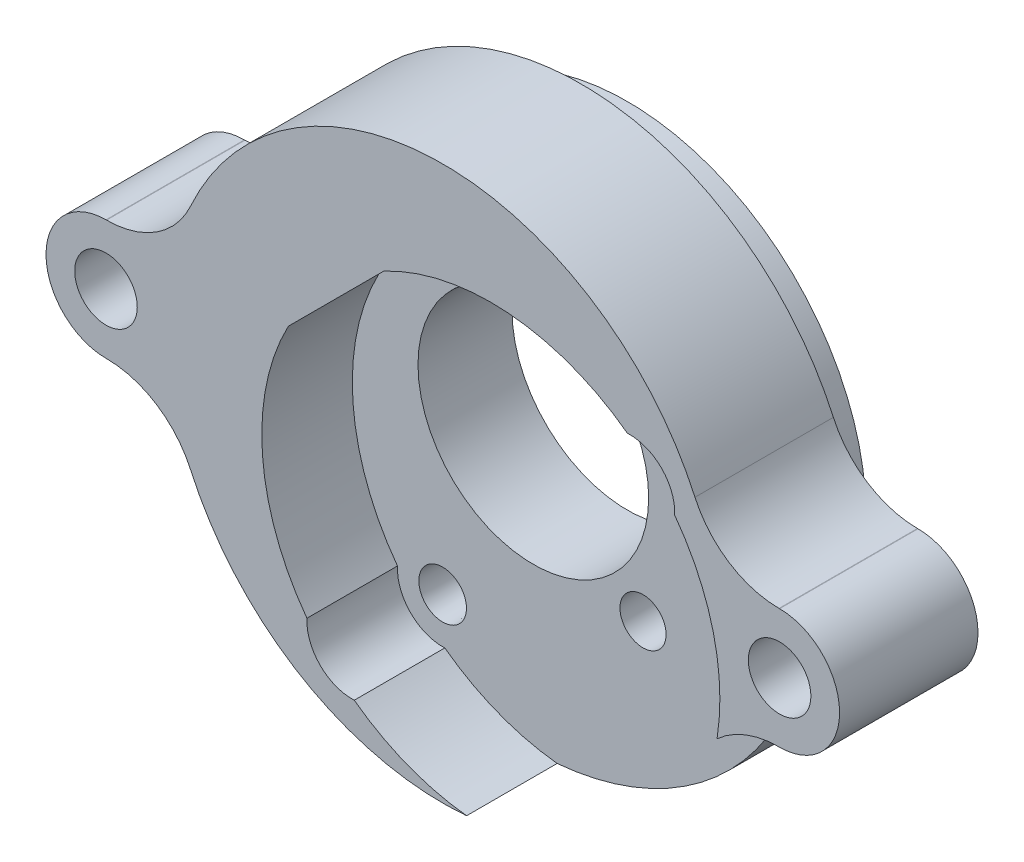
ISO-10303-21;
HEADER;
FILE_DESCRIPTION(('STEP AP214'),'2;1');
FILE_NAME('part.step','',(''),(''),'','','');
FILE_SCHEMA(('AUTOMOTIVE_DESIGN { 1 0 10303 214 1 1 1 1 }'));
ENDSEC;
DATA;
#1=APPLICATION_CONTEXT('core data for automotive mechanical design processes');
#2=APPLICATION_PROTOCOL_DEFINITION('international standard','automotive_design',2000,#1);
#3=PRODUCT_CONTEXT('',#1,'mechanical');
#4=PRODUCT('Part','Part','',(#3));
#5=PRODUCT_RELATED_PRODUCT_CATEGORY('part','',(#4));
#6=PRODUCT_DEFINITION_FORMATION('','',#4);
#7=PRODUCT_DEFINITION_CONTEXT('part definition',#1,'design');
#8=PRODUCT_DEFINITION('design','',#6,#7);
#9=PRODUCT_DEFINITION_SHAPE('','',#8);
#10=(LENGTH_UNIT() NAMED_UNIT(*) SI_UNIT(.MILLI.,.METRE.));
#11=(NAMED_UNIT(*) PLANE_ANGLE_UNIT() SI_UNIT($,.RADIAN.));
#12=(NAMED_UNIT(*) SI_UNIT($,.STERADIAN.) SOLID_ANGLE_UNIT());
#13=UNCERTAINTY_MEASURE_WITH_UNIT(LENGTH_MEASURE(1.E-05),#10,'distance_accuracy_value','');
#14=(GEOMETRIC_REPRESENTATION_CONTEXT(3) GLOBAL_UNCERTAINTY_ASSIGNED_CONTEXT((#13)) GLOBAL_UNIT_ASSIGNED_CONTEXT((#10,
#11,#12)) REPRESENTATION_CONTEXT('',''));
#15=CARTESIAN_POINT('',(0.,0.,0.));
#16=DIRECTION('',(0.,0.,1.));
#17=DIRECTION('',(1.,0.,0.));
#18=AXIS2_PLACEMENT_3D('',#15,#16,#17);
#19=CARTESIAN_POINT('',(3.30562119926443,-3.30562119926438,6.47000000000001));
#20=DIRECTION('',(0.,0.,-1.));
#21=DIRECTION('',(0.707106781186554,-0.707106781186541,0.));
#22=AXIS2_PLACEMENT_3D('',#19,#20,#21);
#23=PLANE('',#22);
#24=CARTESIAN_POINT('',(-6.24032034675388,-12.8515627452829,6.47000000000001));
#25=DIRECTION('',(0.,0.,1.));
#26=DIRECTION('',(1.,0.,0.));
#27=AXIS2_PLACEMENT_3D('',#24,#25,#26);
#28=CIRCLE('',#27,1.63830000000001);
#29=CARTESIAN_POINT('',(-4.60202034675387,-12.8515627452829,6.47000000000001));
#30=VERTEX_POINT('',#29);
#31=EDGE_CURVE('E504',#30,#30,#28,.T.);
#32=ORIENTED_EDGE('',*,*,#31,.F.);
#33=EDGE_LOOP('',(#32));
#34=FACE_BOUND('',#33,.T.);
#35=CARTESIAN_POINT('',(7.54826188638375,-7.54826188638363,6.47000000000001));
#36=DIRECTION('',(0.,0.,-1.));
#37=DIRECTION('',(-1.,0.,0.));
#38=AXIS2_PLACEMENT_3D('',#35,#36,#37);
#39=CIRCLE('',#38,1.5875);
#40=CARTESIAN_POINT('',(5.96076188638375,-7.54826188638363,6.47000000000001));
#41=VERTEX_POINT('',#40);
#42=EDGE_CURVE('E439',#41,#41,#39,.T.);
#43=ORIENTED_EDGE('',*,*,#42,.T.);
#44=EDGE_LOOP('',(#43));
#45=FACE_BOUND('',#44,.T.);
#46=CARTESIAN_POINT('',(0.,0.,6.47000000000001));
#47=DIRECTION('',(0.,0.,-1.));
#48=DIRECTION('',(-1.,0.,0.));
#49=AXIS2_PLACEMENT_3D('',#46,#47,#48);
#50=CIRCLE('',#49,7.9375);
#51=CARTESIAN_POINT('',(-7.9375,0.,6.47000000000001));
#52=VERTEX_POINT('',#51);
#53=EDGE_CURVE('E287',#52,#52,#50,.T.);
#54=ORIENTED_EDGE('',*,*,#53,.T.);
#55=EDGE_LOOP('',(#54));
#56=FACE_BOUND('',#55,.T.);
#57=CARTESIAN_POINT('',(23.1383230539726,-10.4775,6.47000000000001));
#58=DIRECTION('',(0.,0.,-1.));
#59=DIRECTION('',(-1.,0.,0.));
#60=AXIS2_PLACEMENT_3D('',#57,#58,#59);
#61=CIRCLE('',#60,6.35);
#62=CARTESIAN_POINT('',(18.8732975897662,-5.77302789468675,6.47000000000001));
#63=VERTEX_POINT('',#62);
#64=CARTESIAN_POINT('',(17.3537422904795,-7.85812500000001,6.47000000000001));
#65=VERTEX_POINT('',#64);
#66=EDGE_CURVE('E12',#63,#65,#61,.F.);
#67=ORIENTED_EDGE('',*,*,#66,.F.);
#68=CARTESIAN_POINT('',(3.30562119926443,-3.30562119926438,6.47000000000001));
#69=DIRECTION('',(0.,0.,-1.));
#70=DIRECTION('',(-1.,0.,0.));
#71=AXIS2_PLACEMENT_3D('',#68,#69,#70);
#72=CIRCLE('',#71,15.762);
#73=CARTESIAN_POINT('',(15.9600056462192,6.09156977829212,6.47000000000001));
#74=VERTEX_POINT('',#73);
#75=EDGE_CURVE('E67',#63,#74,#72,.F.);
#76=ORIENTED_EDGE('',*,*,#75,.T.);
#77=CARTESIAN_POINT('',(12.8515627452827,6.2403203467541,6.47000000000001));
#78=DIRECTION('',(0.,0.,-1.));
#79=DIRECTION('',(-1.,0.,0.));
#80=AXIS2_PLACEMENT_3D('',#77,#78,#79);
#81=CIRCLE('',#80,3.11200000000001);
#82=CARTESIAN_POINT('',(12.7028121768207,9.34876324769056,6.47000000000001));
#83=VERTEX_POINT('',#82);
#84=EDGE_CURVE('E257',#74,#83,#81,.F.);
#85=ORIENTED_EDGE('',*,*,#84,.T.);
#86=CARTESIAN_POINT('',(3.30562119926443,-3.30562119926438,6.47000000000001));
#87=DIRECTION('',(0.,0.,-1.));
#88=DIRECTION('',(-1.,0.,0.));
#89=AXIS2_PLACEMENT_3D('',#86,#87,#88);
#90=CIRCLE('',#89,15.762);
#91=CARTESIAN_POINT('',(-4.06025115189155,10.6293911260433,6.47000000000001));
#92=VERTEX_POINT('',#91);
#93=EDGE_CURVE('E239',#83,#92,#90,.F.);
#94=ORIENTED_EDGE('',*,*,#93,.T.);
#95=DIRECTION('',(-0.707106781186541,-0.707106781186554,0.));
#96=VECTOR('',#95,1.);
#97=CARTESIAN_POINT('',(-4.06025115189155,10.6293911260433,6.47000000000001));
#98=LINE('',#97,#96);
#99=CARTESIAN_POINT('',(-10.6293911260433,4.06025115189135,6.47000000000001));
#100=VERTEX_POINT('',#99);
#101=EDGE_CURVE('E230',#92,#100,#98,.T.);
#102=ORIENTED_EDGE('',*,*,#101,.T.);
#103=CARTESIAN_POINT('',(3.30562119926443,-3.30562119926438,6.47000000000001));
#104=DIRECTION('',(0.,0.,-1.));
#105=DIRECTION('',(-1.,0.,0.));
#106=AXIS2_PLACEMENT_3D('',#103,#104,#105);
#107=CIRCLE('',#106,15.762);
#108=CARTESIAN_POINT('',(-9.34876324769033,-12.7028121768209,6.47000000000001));
#109=VERTEX_POINT('',#108);
#110=EDGE_CURVE('E216',#100,#109,#107,.F.);
#111=ORIENTED_EDGE('',*,*,#110,.T.);
#112=CARTESIAN_POINT('',(-6.24032034675388,-12.8515627452829,6.47000000000001));
#113=DIRECTION('',(0.,0.,-1.));
#114=DIRECTION('',(-1.,0.,0.));
#115=AXIS2_PLACEMENT_3D('',#112,#113,#114);
#116=CIRCLE('',#115,3.112);
#117=CARTESIAN_POINT('',(-6.09156977829186,-15.9600056462193,6.47000000000001));
#118=VERTEX_POINT('',#117);
#119=EDGE_CURVE('E265',#109,#118,#116,.F.);
#120=ORIENTED_EDGE('',*,*,#119,.T.);
#121=CARTESIAN_POINT('',(1.63951827430508,-18.9793171591662,6.47000000000001));
#122=VERTEX_POINT('',#121);
#123=EDGE_CURVE('E261',#118,#122,#72,.F.);
#124=ORIENTED_EDGE('',*,*,#123,.T.);
#125=CARTESIAN_POINT('',(0.,0.,6.47000000000001));
#126=DIRECTION('',(0.,0.,-1.));
#127=DIRECTION('',(-1.,0.,0.));
#128=AXIS2_PLACEMENT_3D('',#125,#126,#127);
#129=CIRCLE('',#128,19.05);
#130=EDGE_CURVE('E283',#65,#122,#129,.T.);
#131=ORIENTED_EDGE('',*,*,#130,.F.);
#132=EDGE_LOOP('',(#67,#76,#85,#94,#102,#111,#120,#124,#131));
#133=FACE_BOUND('',#132,.T.);
#134=CARTESIAN_POINT('',(12.8515627452827,6.2403203467541,6.47000000000001));
#135=DIRECTION('',(0.,0.,1.));
#136=DIRECTION('',(1.,0.,0.));
#137=AXIS2_PLACEMENT_3D('',#134,#135,#136);
#138=CIRCLE('',#137,1.63830000000001);
#139=CARTESIAN_POINT('',(14.4898627452828,6.2403203467541,6.47000000000001));
#140=VERTEX_POINT('',#139);
#141=EDGE_CURVE('E457',#140,#140,#138,.T.);
#142=ORIENTED_EDGE('',*,*,#141,.F.);
#143=EDGE_LOOP('',(#142));
#144=FACE_BOUND('',#143,.T.);
#145=ADVANCED_FACE('F46',(#34,#45,#56,#133,#144),#23,.F.);
#146=CARTESIAN_POINT('',(23.1775,0.,3.175));
#147=DIRECTION('',(0.,0.,1.));
#148=DIRECTION('',(1.,0.,0.));
#149=AXIS2_PLACEMENT_3D('',#146,#147,#148);
#150=PLANE('',#149);
#151=CARTESIAN_POINT('',(23.1775,0.,3.175));
#152=DIRECTION('',(0.,0.,-1.));
#153=DIRECTION('',(-1.,0.,0.));
#154=AXIS2_PLACEMENT_3D('',#151,#152,#153);
#155=CIRCLE('',#154,2.65430000000001);
#156=CARTESIAN_POINT('',(20.5232,0.,3.175));
#157=VERTEX_POINT('',#156);
#158=EDGE_CURVE('E291',#157,#157,#155,.T.);
#159=ORIENTED_EDGE('',*,*,#158,.F.);
#160=EDGE_LOOP('',(#159));
#161=FACE_BOUND('',#160,.T.);
#162=CARTESIAN_POINT('',(-23.1775,0.,3.175));
#163=DIRECTION('',(0.,0.,-1.));
#164=DIRECTION('',(-1.,0.,0.));
#165=AXIS2_PLACEMENT_3D('',#162,#163,#164);
#166=CIRCLE('',#165,2.65430000000001);
#167=CARTESIAN_POINT('',(-25.8318,0.,3.175));
#168=VERTEX_POINT('',#167);
#169=EDGE_CURVE('E300',#168,#168,#166,.T.);
#170=ORIENTED_EDGE('',*,*,#169,.F.);
#171=EDGE_LOOP('',(#170));
#172=FACE_BOUND('',#171,.T.);
#173=CARTESIAN_POINT('',(0.,0.,3.175));
#174=DIRECTION('',(0.,0.,1.));
#175=DIRECTION('',(1.,0.,0.));
#176=AXIS2_PLACEMENT_3D('',#173,#174,#175);
#177=CIRCLE('',#176,16.4211);
#178=CARTESIAN_POINT('',(16.4211,0.,3.175));
#179=VERTEX_POINT('',#178);
#180=EDGE_CURVE('E428',#179,#179,#177,.T.);
#181=ORIENTED_EDGE('',*,*,#180,.T.);
#182=EDGE_LOOP('',(#181));
#183=FACE_BOUND('',#182,.T.);
#184=CARTESIAN_POINT('',(23.1775,0.,3.175));
#185=DIRECTION('',(0.,0.,1.));
#186=DIRECTION('',(1.,0.,0.));
#187=AXIS2_PLACEMENT_3D('',#184,#185,#186);
#188=CIRCLE('',#187,4.1275);
#189=CARTESIAN_POINT('',(23.1775,-4.1275,3.175));
#190=VERTEX_POINT('',#189);
#191=CARTESIAN_POINT('',(23.1775,4.1275,3.175));
#192=VERTEX_POINT('',#191);
#193=EDGE_CURVE('E314',#190,#192,#188,.T.);
#194=ORIENTED_EDGE('',*,*,#193,.F.);
#195=DIRECTION('',(1.,0.,0.));
#196=VECTOR('',#195,1.);
#197=CARTESIAN_POINT('',(23.1383230539726,-4.1275,3.175));
#198=LINE('',#197,#196);
#199=CARTESIAN_POINT('',(23.1383230539726,-4.1275,3.175));
#200=VERTEX_POINT('',#199);
#201=EDGE_CURVE('E353',#200,#190,#198,.T.);
#202=ORIENTED_EDGE('',*,*,#201,.F.);
#203=CARTESIAN_POINT('',(23.1383230539726,-10.4775,3.175));
#204=DIRECTION('',(0.,0.,-1.));
#205=DIRECTION('',(1.,0.,0.));
#206=AXIS2_PLACEMENT_3D('',#203,#204,#205);
#207=CIRCLE('',#206,6.35);
#208=CARTESIAN_POINT('',(17.3537422904795,-7.85812500000001,3.175));
#209=VERTEX_POINT('',#208);
#210=EDGE_CURVE('E349',#209,#200,#207,.T.);
#211=ORIENTED_EDGE('',*,*,#210,.F.);
#212=CARTESIAN_POINT('',(0.,0.,3.175));
#213=DIRECTION('',(0.,0.,1.));
#214=DIRECTION('',(1.,0.,0.));
#215=AXIS2_PLACEMENT_3D('',#212,#213,#214);
#216=CIRCLE('',#215,19.05);
#217=CARTESIAN_POINT('',(-17.3537422904795,-7.858125,3.175));
#218=VERTEX_POINT('',#217);
#219=EDGE_CURVE('E345',#218,#209,#216,.T.);
#220=ORIENTED_EDGE('',*,*,#219,.F.);
#221=CARTESIAN_POINT('',(-23.1383230539726,-10.4775,3.175));
#222=DIRECTION('',(0.,0.,-1.));
#223=DIRECTION('',(1.,0.,0.));
#224=AXIS2_PLACEMENT_3D('',#221,#222,#223);
#225=CIRCLE('',#224,6.35);
#226=CARTESIAN_POINT('',(-23.1383230539726,-4.1275,3.175));
#227=VERTEX_POINT('',#226);
#228=EDGE_CURVE('E342',#227,#218,#225,.T.);
#229=ORIENTED_EDGE('',*,*,#228,.F.);
#230=DIRECTION('',(1.,0.,0.));
#231=VECTOR('',#230,1.);
#232=CARTESIAN_POINT('',(-23.1775,-4.1275,3.175));
#233=LINE('',#232,#231);
#234=CARTESIAN_POINT('',(-23.1775,-4.1275,3.175));
#235=VERTEX_POINT('',#234);
#236=EDGE_CURVE('E339',#235,#227,#233,.T.);
#237=ORIENTED_EDGE('',*,*,#236,.F.);
#238=CARTESIAN_POINT('',(-23.1775,0.,3.175));
#239=DIRECTION('',(0.,0.,1.));
#240=DIRECTION('',(1.,0.,0.));
#241=AXIS2_PLACEMENT_3D('',#238,#239,#240);
#242=CIRCLE('',#241,4.1275);
#243=CARTESIAN_POINT('',(-23.1775,4.1275,3.175));
#244=VERTEX_POINT('',#243);
#245=EDGE_CURVE('E336',#244,#235,#242,.T.);
#246=ORIENTED_EDGE('',*,*,#245,.F.);
#247=DIRECTION('',(-1.,0.,0.));
#248=VECTOR('',#247,1.);
#249=CARTESIAN_POINT('',(-23.1383230539726,4.1275,3.175));
#250=LINE('',#249,#248);
#251=CARTESIAN_POINT('',(-23.1383230539726,4.1275,3.175));
#252=VERTEX_POINT('',#251);
#253=EDGE_CURVE('E333',#252,#244,#250,.T.);
#254=ORIENTED_EDGE('',*,*,#253,.F.);
#255=CARTESIAN_POINT('',(-23.1383230539726,10.4775,3.175));
#256=DIRECTION('',(0.,0.,-1.));
#257=DIRECTION('',(1.,0.,0.));
#258=AXIS2_PLACEMENT_3D('',#255,#256,#257);
#259=CIRCLE('',#258,6.35);
#260=CARTESIAN_POINT('',(-17.3537422904795,7.858125,3.175));
#261=VERTEX_POINT('',#260);
#262=EDGE_CURVE('E330',#261,#252,#259,.T.);
#263=ORIENTED_EDGE('',*,*,#262,.F.);
#264=CARTESIAN_POINT('',(0.,0.,3.175));
#265=DIRECTION('',(0.,0.,1.));
#266=DIRECTION('',(1.,0.,0.));
#267=AXIS2_PLACEMENT_3D('',#264,#265,#266);
#268=CIRCLE('',#267,19.05);
#269=CARTESIAN_POINT('',(17.3537422904795,7.858125,3.175));
#270=VERTEX_POINT('',#269);
#271=EDGE_CURVE('E326',#270,#261,#268,.T.);
#272=ORIENTED_EDGE('',*,*,#271,.F.);
#273=CARTESIAN_POINT('',(23.1383230539726,10.4775,3.175));
#274=DIRECTION('',(0.,0.,-1.));
#275=DIRECTION('',(1.,0.,0.));
#276=AXIS2_PLACEMENT_3D('',#273,#274,#275);
#277=CIRCLE('',#276,6.35);
#278=CARTESIAN_POINT('',(23.1383230539726,4.1275,3.175));
#279=VERTEX_POINT('',#278);
#280=EDGE_CURVE('E322',#279,#270,#277,.T.);
#281=ORIENTED_EDGE('',*,*,#280,.F.);
#282=DIRECTION('',(-1.,0.,0.));
#283=VECTOR('',#282,1.);
#284=CARTESIAN_POINT('',(23.1775,4.1275,3.175));
#285=LINE('',#284,#283);
#286=EDGE_CURVE('E318',#192,#279,#285,.T.);
#287=ORIENTED_EDGE('',*,*,#286,.F.);
#288=EDGE_LOOP('',(#194,#202,#211,#220,#229,#237,#246,#254,#263,#272,#281,#287));
#289=FACE_BOUND('',#288,.T.);
#290=ADVANCED_FACE('F491',(#161,#172,#183,#289),#150,.F.);
#291=CARTESIAN_POINT('',(0.,0.,6.35));
#292=DIRECTION('',(0.,0.,-1.));
#293=DIRECTION('',(-1.,0.,0.));
#294=AXIS2_PLACEMENT_3D('',#291,#292,#293);
#295=CYLINDRICAL_SURFACE('',#294,16.4211);
#296=CARTESIAN_POINT('',(0.,0.,0.));
#297=DIRECTION('',(0.,0.,1.));
#298=DIRECTION('',(1.,0.,0.));
#299=AXIS2_PLACEMENT_3D('',#296,#297,#298);
#300=CIRCLE('',#299,16.4211);
#301=CARTESIAN_POINT('',(16.4211,0.,0.));
#302=VERTEX_POINT('',#301);
#303=EDGE_CURVE('E424',#302,#302,#300,.T.);
#304=ORIENTED_EDGE('',*,*,#303,.T.);
#305=EDGE_LOOP('',(#304));
#306=FACE_BOUND('',#305,.T.);
#307=ORIENTED_EDGE('',*,*,#180,.F.);
#308=EDGE_LOOP('',(#307));
#309=FACE_BOUND('',#308,.T.);
#310=ADVANCED_FACE('F536',(#306,#309),#295,.T.);
#311=CARTESIAN_POINT('',(0.,0.,6.35));
#312=DIRECTION('',(0.,0.,-1.));
#313=DIRECTION('',(-1.,0.,0.));
#314=AXIS2_PLACEMENT_3D('',#311,#312,#313);
#315=CYLINDRICAL_SURFACE('',#314,7.9375);
#316=ORIENTED_EDGE('',*,*,#53,.F.);
#317=EDGE_LOOP('',(#316));
#318=FACE_BOUND('',#317,.T.);
#319=CARTESIAN_POINT('',(0.,0.,0.));
#320=DIRECTION('',(0.,0.,1.));
#321=DIRECTION('',(1.,0.,0.));
#322=AXIS2_PLACEMENT_3D('',#319,#320,#321);
#323=CIRCLE('',#322,7.9375);
#324=CARTESIAN_POINT('',(7.9375,0.,0.));
#325=VERTEX_POINT('',#324);
#326=EDGE_CURVE('E420',#325,#325,#323,.T.);
#327=ORIENTED_EDGE('',*,*,#326,.F.);
#328=EDGE_LOOP('',(#327));
#329=FACE_BOUND('',#328,.T.);
#330=ADVANCED_FACE('F48',(#318,#329),#315,.F.);
#331=CARTESIAN_POINT('',(0.,0.,0.));
#332=DIRECTION('',(0.,0.,1.));
#333=DIRECTION('',(1.,0.,0.));
#334=AXIS2_PLACEMENT_3D('',#331,#332,#333);
#335=PLANE('',#334);
#336=CARTESIAN_POINT('',(-6.24032034675388,-12.8515627452829,0.));
#337=DIRECTION('',(0.,0.,1.));
#338=DIRECTION('',(1.,0.,0.));
#339=AXIS2_PLACEMENT_3D('',#336,#337,#338);
#340=CIRCLE('',#339,0.927099999999998);
#341=CARTESIAN_POINT('',(-5.31322034675388,-12.8515627452829,0.));
#342=VERTEX_POINT('',#341);
#343=EDGE_CURVE('E520',#342,#342,#340,.T.);
#344=ORIENTED_EDGE('',*,*,#343,.T.);
#345=EDGE_LOOP('',(#344));
#346=FACE_BOUND('',#345,.T.);
#347=CARTESIAN_POINT('',(12.8515627452827,6.2403203467541,0.));
#348=DIRECTION('',(0.,0.,1.));
#349=DIRECTION('',(1.,0.,0.));
#350=AXIS2_PLACEMENT_3D('',#347,#348,#349);
#351=CIRCLE('',#350,0.927099999999998);
#352=CARTESIAN_POINT('',(13.7786627452827,6.2403203467541,0.));
#353=VERTEX_POINT('',#352);
#354=EDGE_CURVE('E505',#353,#353,#351,.T.);
#355=ORIENTED_EDGE('',*,*,#354,.T.);
#356=EDGE_LOOP('',(#355));
#357=FACE_BOUND('',#356,.T.);
#358=CARTESIAN_POINT('',(7.54826188638375,-7.54826188638363,0.));
#359=DIRECTION('',(0.,0.,-1.));
#360=DIRECTION('',(-1.,0.,0.));
#361=AXIS2_PLACEMENT_3D('',#358,#359,#360);
#362=CIRCLE('',#361,1.5875);
#363=CARTESIAN_POINT('',(5.96076188638375,-7.54826188638363,0.));
#364=VERTEX_POINT('',#363);
#365=EDGE_CURVE('E442',#364,#364,#362,.T.);
#366=ORIENTED_EDGE('',*,*,#365,.F.);
#367=EDGE_LOOP('',(#366));
#368=FACE_BOUND('',#367,.T.);
#369=ORIENTED_EDGE('',*,*,#326,.T.);
#370=EDGE_LOOP('',(#369));
#371=FACE_BOUND('',#370,.T.);
#372=ORIENTED_EDGE('',*,*,#303,.F.);
#373=EDGE_LOOP('',(#372));
#374=FACE_BOUND('',#373,.T.);
#375=ADVANCED_FACE('F571',(#346,#357,#368,#371,#374),#335,.F.);
#376=CARTESIAN_POINT('',(23.1775,0.,12.7));
#377=DIRECTION('',(0.,0.,1.));
#378=DIRECTION('',(1.,0.,0.));
#379=AXIS2_PLACEMENT_3D('',#376,#377,#378);
#380=PLANE('',#379);
#381=CARTESIAN_POINT('',(3.30562119926443,-3.30562119926438,12.7));
#382=DIRECTION('',(0.,0.,1.));
#383=DIRECTION('',(1.,0.,0.));
#384=AXIS2_PLACEMENT_3D('',#381,#382,#383);
#385=CIRCLE('',#384,15.762);
#386=CARTESIAN_POINT('',(-6.09156977829186,-15.9600056462193,12.7));
#387=VERTEX_POINT('',#386);
#388=CARTESIAN_POINT('',(1.63951827430508,-18.9793171591662,12.7));
#389=VERTEX_POINT('',#388);
#390=EDGE_CURVE('E247',#387,#389,#385,.T.);
#391=ORIENTED_EDGE('',*,*,#390,.F.);
#392=CARTESIAN_POINT('',(-6.24032034675388,-12.8515627452829,12.7));
#393=DIRECTION('',(0.,0.,1.));
#394=DIRECTION('',(1.,0.,0.));
#395=AXIS2_PLACEMENT_3D('',#392,#393,#394);
#396=CIRCLE('',#395,3.112);
#397=CARTESIAN_POINT('',(-9.34876324769033,-12.7028121768209,12.7));
#398=VERTEX_POINT('',#397);
#399=EDGE_CURVE('E464',#398,#387,#396,.T.);
#400=ORIENTED_EDGE('',*,*,#399,.F.);
#401=CARTESIAN_POINT('',(3.30562119926443,-3.30562119926438,12.7));
#402=DIRECTION('',(0.,0.,1.));
#403=DIRECTION('',(1.,0.,0.));
#404=AXIS2_PLACEMENT_3D('',#401,#402,#403);
#405=CIRCLE('',#404,15.762);
#406=CARTESIAN_POINT('',(-10.6293911260433,4.06025115189135,12.7));
#407=VERTEX_POINT('',#406);
#408=EDGE_CURVE('E468',#407,#398,#405,.T.);
#409=ORIENTED_EDGE('',*,*,#408,.F.);
#410=DIRECTION('',(-0.707106781186541,-0.707106781186554,0.));
#411=VECTOR('',#410,1.);
#412=CARTESIAN_POINT('',(-4.06025115189155,10.6293911260433,12.7));
#413=LINE('',#412,#411);
#414=CARTESIAN_POINT('',(-4.06025115189155,10.6293911260433,12.7));
#415=VERTEX_POINT('',#414);
#416=EDGE_CURVE('E233',#415,#407,#413,.T.);
#417=ORIENTED_EDGE('',*,*,#416,.F.);
#418=CARTESIAN_POINT('',(3.30562119926443,-3.30562119926438,12.7));
#419=DIRECTION('',(0.,0.,1.));
#420=DIRECTION('',(1.,0.,0.));
#421=AXIS2_PLACEMENT_3D('',#418,#419,#420);
#422=CIRCLE('',#421,15.762);
#423=CARTESIAN_POINT('',(12.7028121768207,9.34876324769056,12.7));
#424=VERTEX_POINT('',#423);
#425=EDGE_CURVE('E251',#424,#415,#422,.T.);
#426=ORIENTED_EDGE('',*,*,#425,.F.);
#427=CARTESIAN_POINT('',(12.8515627452827,6.2403203467541,12.7));
#428=DIRECTION('',(0.,0.,1.));
#429=DIRECTION('',(1.,0.,0.));
#430=AXIS2_PLACEMENT_3D('',#427,#428,#429);
#431=CIRCLE('',#430,3.11200000000001);
#432=CARTESIAN_POINT('',(15.9600056462192,6.09156977829212,12.7));
#433=VERTEX_POINT('',#432);
#434=EDGE_CURVE('E242',#433,#424,#431,.T.);
#435=ORIENTED_EDGE('',*,*,#434,.F.);
#436=CARTESIAN_POINT('',(18.8732975897662,-5.77302789468674,12.7));
#437=VERTEX_POINT('',#436);
#438=EDGE_CURVE('E463',#437,#433,#385,.T.);
#439=ORIENTED_EDGE('',*,*,#438,.F.);
#440=CARTESIAN_POINT('',(23.1383230539726,-10.4775,12.7));
#441=DIRECTION('',(0.,0.,-1.));
#442=DIRECTION('',(1.,0.,0.));
#443=AXIS2_PLACEMENT_3D('',#440,#441,#442);
#444=CIRCLE('',#443,6.35);
#445=CARTESIAN_POINT('',(23.1383230539726,-4.1275,12.7));
#446=VERTEX_POINT('',#445);
#447=EDGE_CURVE('E384',#437,#446,#444,.T.);
#448=ORIENTED_EDGE('',*,*,#447,.T.);
#449=DIRECTION('',(1.,0.,0.));
#450=VECTOR('',#449,1.);
#451=CARTESIAN_POINT('',(23.1383230539726,-4.1275,12.7));
#452=LINE('',#451,#450);
#453=CARTESIAN_POINT('',(23.1775,-4.1275,12.7));
#454=VERTEX_POINT('',#453);
#455=EDGE_CURVE('E78',#446,#454,#452,.T.);
#456=ORIENTED_EDGE('',*,*,#455,.T.);
#457=CARTESIAN_POINT('',(23.1775,0.,12.7));
#458=DIRECTION('',(0.,0.,1.));
#459=DIRECTION('',(1.,0.,0.));
#460=AXIS2_PLACEMENT_3D('',#457,#458,#459);
#461=CIRCLE('',#460,4.1275);
#462=CARTESIAN_POINT('',(23.1775,4.1275,12.7));
#463=VERTEX_POINT('',#462);
#464=EDGE_CURVE('E357',#454,#463,#461,.T.);
#465=ORIENTED_EDGE('',*,*,#464,.T.);
#466=DIRECTION('',(-1.,0.,0.));
#467=VECTOR('',#466,1.);
#468=CARTESIAN_POINT('',(23.1775,4.1275,12.7));
#469=LINE('',#468,#467);
#470=CARTESIAN_POINT('',(23.1383230539726,4.1275,12.7));
#471=VERTEX_POINT('',#470);
#472=EDGE_CURVE('E360',#463,#471,#469,.T.);
#473=ORIENTED_EDGE('',*,*,#472,.T.);
#474=CARTESIAN_POINT('',(23.1383230539726,10.4775,12.7));
#475=DIRECTION('',(0.,0.,-1.));
#476=DIRECTION('',(1.,0.,0.));
#477=AXIS2_PLACEMENT_3D('',#474,#475,#476);
#478=CIRCLE('',#477,6.35);
#479=CARTESIAN_POINT('',(17.3537422904795,7.858125,12.7));
#480=VERTEX_POINT('',#479);
#481=EDGE_CURVE('E363',#471,#480,#478,.T.);
#482=ORIENTED_EDGE('',*,*,#481,.T.);
#483=CARTESIAN_POINT('',(0.,0.,12.7));
#484=DIRECTION('',(0.,0.,1.));
#485=DIRECTION('',(1.,0.,0.));
#486=AXIS2_PLACEMENT_3D('',#483,#484,#485);
#487=CIRCLE('',#486,19.05);
#488=CARTESIAN_POINT('',(-17.3537422904795,7.858125,12.7));
#489=VERTEX_POINT('',#488);
#490=EDGE_CURVE('E366',#480,#489,#487,.T.);
#491=ORIENTED_EDGE('',*,*,#490,.T.);
#492=CARTESIAN_POINT('',(-23.1383230539726,10.4775,12.7));
#493=DIRECTION('',(0.,0.,-1.));
#494=DIRECTION('',(1.,0.,0.));
#495=AXIS2_PLACEMENT_3D('',#492,#493,#494);
#496=CIRCLE('',#495,6.35);
#497=CARTESIAN_POINT('',(-23.1383230539726,4.1275,12.7));
#498=VERTEX_POINT('',#497);
#499=EDGE_CURVE('E369',#489,#498,#496,.T.);
#500=ORIENTED_EDGE('',*,*,#499,.T.);
#501=DIRECTION('',(-1.,0.,0.));
#502=VECTOR('',#501,1.);
#503=CARTESIAN_POINT('',(-23.1383230539726,4.1275,12.7));
#504=LINE('',#503,#502);
#505=CARTESIAN_POINT('',(-23.1775,4.1275,12.7));
#506=VERTEX_POINT('',#505);
#507=EDGE_CURVE('E371',#498,#506,#504,.T.);
#508=ORIENTED_EDGE('',*,*,#507,.T.);
#509=CARTESIAN_POINT('',(-23.1775,0.,12.7));
#510=DIRECTION('',(0.,0.,1.));
#511=DIRECTION('',(1.,0.,0.));
#512=AXIS2_PLACEMENT_3D('',#509,#510,#511);
#513=CIRCLE('',#512,4.1275);
#514=CARTESIAN_POINT('',(-23.1775,-4.1275,12.7));
#515=VERTEX_POINT('',#514);
#516=EDGE_CURVE('E373',#506,#515,#513,.T.);
#517=ORIENTED_EDGE('',*,*,#516,.T.);
#518=DIRECTION('',(1.,0.,0.));
#519=VECTOR('',#518,1.);
#520=CARTESIAN_POINT('',(-23.1775,-4.1275,12.7));
#521=LINE('',#520,#519);
#522=CARTESIAN_POINT('',(-23.1383230539726,-4.1275,12.7));
#523=VERTEX_POINT('',#522);
#524=EDGE_CURVE('E375',#515,#523,#521,.T.);
#525=ORIENTED_EDGE('',*,*,#524,.T.);
#526=CARTESIAN_POINT('',(-23.1383230539726,-10.4775,12.7));
#527=DIRECTION('',(0.,0.,-1.));
#528=DIRECTION('',(1.,0.,0.));
#529=AXIS2_PLACEMENT_3D('',#526,#527,#528);
#530=CIRCLE('',#529,6.35);
#531=CARTESIAN_POINT('',(-17.3537422904795,-7.858125,12.7));
#532=VERTEX_POINT('',#531);
#533=EDGE_CURVE('E377',#523,#532,#530,.T.);
#534=ORIENTED_EDGE('',*,*,#533,.T.);
#535=CARTESIAN_POINT('',(0.,0.,12.7));
#536=DIRECTION('',(0.,0.,1.));
#537=DIRECTION('',(1.,0.,0.));
#538=AXIS2_PLACEMENT_3D('',#535,#536,#537);
#539=CIRCLE('',#538,19.05);
#540=EDGE_CURVE('E380',#532,#389,#539,.T.);
#541=ORIENTED_EDGE('',*,*,#540,.T.);
#542=EDGE_LOOP('',(#391,#400,#409,#417,#426,#435,#439,#448,#456,#465,#473,#482,#491,#500,#508,
#517,#525,#534,#541));
#543=FACE_BOUND('',#542,.T.);
#544=CARTESIAN_POINT('',(23.1775,0.,12.7));
#545=DIRECTION('',(0.,0.,1.));
#546=DIRECTION('',(1.,0.,0.));
#547=AXIS2_PLACEMENT_3D('',#544,#545,#546);
#548=CIRCLE('',#547,2.15264999999999);
#549=CARTESIAN_POINT('',(25.33015,0.,12.7));
#550=VERTEX_POINT('',#549);
#551=EDGE_CURVE('E307',#550,#550,#548,.T.);
#552=ORIENTED_EDGE('',*,*,#551,.F.);
#553=EDGE_LOOP('',(#552));
#554=FACE_BOUND('',#553,.T.);
#555=CARTESIAN_POINT('',(-23.1775,0.,12.7));
#556=DIRECTION('',(0.,0.,1.));
#557=DIRECTION('',(1.,0.,0.));
#558=AXIS2_PLACEMENT_3D('',#555,#556,#557);
#559=CIRCLE('',#558,2.15264999999999);
#560=CARTESIAN_POINT('',(-21.02485,0.,12.7));
#561=VERTEX_POINT('',#560);
#562=EDGE_CURVE('E311',#561,#561,#559,.T.);
#563=ORIENTED_EDGE('',*,*,#562,.F.);
#564=EDGE_LOOP('',(#563));
#565=FACE_BOUND('',#564,.T.);
#566=ADVANCED_FACE('F473',(#543,#554,#565),#380,.T.);
#567=CARTESIAN_POINT('',(23.1775,0.,12.7));
#568=DIRECTION('',(0.,0.,-1.));
#569=DIRECTION('',(-1.,0.,0.));
#570=AXIS2_PLACEMENT_3D('',#567,#568,#569);
#571=CYLINDRICAL_SURFACE('',#570,4.1275);
#572=DIRECTION('',(0.,0.,-1.));
#573=VECTOR('',#572,1.);
#574=CARTESIAN_POINT('',(23.1775,-4.1275,12.7));
#575=LINE('',#574,#573);
#576=EDGE_CURVE('E389',#454,#190,#575,.T.);
#577=ORIENTED_EDGE('',*,*,#576,.T.);
#578=ORIENTED_EDGE('',*,*,#193,.T.);
#579=DIRECTION('',(0.,0.,-1.));
#580=VECTOR('',#579,1.);
#581=CARTESIAN_POINT('',(23.1775,4.1275,12.7));
#582=LINE('',#581,#580);
#583=EDGE_CURVE('E417',#463,#192,#582,.T.);
#584=ORIENTED_EDGE('',*,*,#583,.F.);
#585=ORIENTED_EDGE('',*,*,#464,.F.);
#586=EDGE_LOOP('',(#577,#578,#584,#585));
#587=FACE_BOUND('',#586,.T.);
#588=ADVANCED_FACE('F570',(#587),#571,.T.);
#589=CARTESIAN_POINT('',(23.1775,4.1275,12.7));
#590=DIRECTION('',(0.,-1.,0.));
#591=DIRECTION('',(0.,0.,-1.));
#592=AXIS2_PLACEMENT_3D('',#589,#590,#591);
#593=PLANE('',#592);
#594=ORIENTED_EDGE('',*,*,#583,.T.);
#595=ORIENTED_EDGE('',*,*,#286,.T.);
#596=DIRECTION('',(0.,0.,-1.));
#597=VECTOR('',#596,1.);
#598=CARTESIAN_POINT('',(23.1383230539726,4.1275,12.7));
#599=LINE('',#598,#597);
#600=EDGE_CURVE('E414',#471,#279,#599,.T.);
#601=ORIENTED_EDGE('',*,*,#600,.F.);
#602=ORIENTED_EDGE('',*,*,#472,.F.);
#603=EDGE_LOOP('',(#594,#595,#601,#602));
#604=FACE_BOUND('',#603,.T.);
#605=ADVANCED_FACE('F605',(#604),#593,.F.);
#606=CARTESIAN_POINT('',(23.1383230539726,10.4775,12.7));
#607=DIRECTION('',(0.,0.,-1.));
#608=DIRECTION('',(-1.,0.,0.));
#609=AXIS2_PLACEMENT_3D('',#606,#607,#608);
#610=CYLINDRICAL_SURFACE('',#609,6.35);
#611=ORIENTED_EDGE('',*,*,#600,.T.);
#612=ORIENTED_EDGE('',*,*,#280,.T.);
#613=DIRECTION('',(0.,0.,-1.));
#614=VECTOR('',#613,1.);
#615=CARTESIAN_POINT('',(17.3537422904795,7.858125,12.7));
#616=LINE('',#615,#614);
#617=EDGE_CURVE('E411',#480,#270,#616,.T.);
#618=ORIENTED_EDGE('',*,*,#617,.F.);
#619=ORIENTED_EDGE('',*,*,#481,.F.);
#620=EDGE_LOOP('',(#611,#612,#618,#619));
#621=FACE_BOUND('',#620,.T.);
#622=ADVANCED_FACE('F601',(#621),#610,.F.);
#623=CARTESIAN_POINT('',(0.,0.,12.7));
#624=DIRECTION('',(0.,0.,-1.));
#625=DIRECTION('',(-1.,0.,0.));
#626=AXIS2_PLACEMENT_3D('',#623,#624,#625);
#627=CYLINDRICAL_SURFACE('',#626,19.05);
#628=ORIENTED_EDGE('',*,*,#617,.T.);
#629=ORIENTED_EDGE('',*,*,#271,.T.);
#630=DIRECTION('',(0.,0.,-1.));
#631=VECTOR('',#630,1.);
#632=CARTESIAN_POINT('',(-17.3537422904795,7.858125,12.7));
#633=LINE('',#632,#631);
#634=EDGE_CURVE('E409',#489,#261,#633,.T.);
#635=ORIENTED_EDGE('',*,*,#634,.F.);
#636=ORIENTED_EDGE('',*,*,#490,.F.);
#637=EDGE_LOOP('',(#628,#629,#635,#636));
#638=FACE_BOUND('',#637,.T.);
#639=ADVANCED_FACE('F597',(#638),#627,.T.);
#640=CARTESIAN_POINT('',(-23.1383230539726,10.4775,12.7));
#641=DIRECTION('',(0.,0.,-1.));
#642=DIRECTION('',(-1.,0.,0.));
#643=AXIS2_PLACEMENT_3D('',#640,#641,#642);
#644=CYLINDRICAL_SURFACE('',#643,6.35);
#645=ORIENTED_EDGE('',*,*,#634,.T.);
#646=ORIENTED_EDGE('',*,*,#262,.T.);
#647=DIRECTION('',(0.,0.,-1.));
#648=VECTOR('',#647,1.);
#649=CARTESIAN_POINT('',(-23.1383230539726,4.1275,12.7));
#650=LINE('',#649,#648);
#651=EDGE_CURVE('E407',#498,#252,#650,.T.);
#652=ORIENTED_EDGE('',*,*,#651,.F.);
#653=ORIENTED_EDGE('',*,*,#499,.F.);
#654=EDGE_LOOP('',(#645,#646,#652,#653));
#655=FACE_BOUND('',#654,.T.);
#656=ADVANCED_FACE('F593',(#655),#644,.F.);
#657=CARTESIAN_POINT('',(-23.1383230539726,4.1275,12.7));
#658=DIRECTION('',(0.,-1.,0.));
#659=DIRECTION('',(1.,0.,0.));
#660=AXIS2_PLACEMENT_3D('',#657,#658,#659);
#661=PLANE('',#660);
#662=ORIENTED_EDGE('',*,*,#651,.T.);
#663=ORIENTED_EDGE('',*,*,#253,.T.);
#664=DIRECTION('',(0.,0.,-1.));
#665=VECTOR('',#664,1.);
#666=CARTESIAN_POINT('',(-23.1775,4.1275,12.7));
#667=LINE('',#666,#665);
#668=EDGE_CURVE('E405',#506,#244,#667,.T.);
#669=ORIENTED_EDGE('',*,*,#668,.F.);
#670=ORIENTED_EDGE('',*,*,#507,.F.);
#671=EDGE_LOOP('',(#662,#663,#669,#670));
#672=FACE_BOUND('',#671,.T.);
#673=ADVANCED_FACE('F589',(#672),#661,.F.);
#674=CARTESIAN_POINT('',(-23.1775,0.,12.7));
#675=DIRECTION('',(0.,0.,-1.));
#676=DIRECTION('',(-1.,0.,0.));
#677=AXIS2_PLACEMENT_3D('',#674,#675,#676);
#678=CYLINDRICAL_SURFACE('',#677,4.1275);
#679=ORIENTED_EDGE('',*,*,#668,.T.);
#680=ORIENTED_EDGE('',*,*,#245,.T.);
#681=DIRECTION('',(0.,0.,-1.));
#682=VECTOR('',#681,1.);
#683=CARTESIAN_POINT('',(-23.1775,-4.1275,12.7));
#684=LINE('',#683,#682);
#685=EDGE_CURVE('E403',#515,#235,#684,.T.);
#686=ORIENTED_EDGE('',*,*,#685,.F.);
#687=ORIENTED_EDGE('',*,*,#516,.F.);
#688=EDGE_LOOP('',(#679,#680,#686,#687));
#689=FACE_BOUND('',#688,.T.);
#690=ADVANCED_FACE('F585',(#689),#678,.T.);
#691=CARTESIAN_POINT('',(-23.1775,-4.1275,12.7));
#692=DIRECTION('',(0.,1.,0.));
#693=DIRECTION('',(0.,0.,1.));
#694=AXIS2_PLACEMENT_3D('',#691,#692,#693);
#695=PLANE('',#694);
#696=ORIENTED_EDGE('',*,*,#685,.T.);
#697=ORIENTED_EDGE('',*,*,#236,.T.);
#698=DIRECTION('',(0.,0.,-1.));
#699=VECTOR('',#698,1.);
#700=CARTESIAN_POINT('',(-23.1383230539726,-4.1275,12.7));
#701=LINE('',#700,#699);
#702=EDGE_CURVE('E401',#523,#227,#701,.T.);
#703=ORIENTED_EDGE('',*,*,#702,.F.);
#704=ORIENTED_EDGE('',*,*,#524,.F.);
#705=EDGE_LOOP('',(#696,#697,#703,#704));
#706=FACE_BOUND('',#705,.T.);
#707=ADVANCED_FACE('F581',(#706),#695,.F.);
#708=CARTESIAN_POINT('',(-23.1383230539726,-10.4775,12.7));
#709=DIRECTION('',(0.,0.,-1.));
#710=DIRECTION('',(-1.,0.,0.));
#711=AXIS2_PLACEMENT_3D('',#708,#709,#710);
#712=CYLINDRICAL_SURFACE('',#711,6.35);
#713=ORIENTED_EDGE('',*,*,#702,.T.);
#714=ORIENTED_EDGE('',*,*,#228,.T.);
#715=DIRECTION('',(0.,0.,-1.));
#716=VECTOR('',#715,1.);
#717=CARTESIAN_POINT('',(-17.3537422904795,-7.858125,12.7));
#718=LINE('',#717,#716);
#719=EDGE_CURVE('E398',#532,#218,#718,.T.);
#720=ORIENTED_EDGE('',*,*,#719,.F.);
#721=ORIENTED_EDGE('',*,*,#533,.F.);
#722=EDGE_LOOP('',(#713,#714,#720,#721));
#723=FACE_BOUND('',#722,.T.);
#724=ADVANCED_FACE('F578',(#723),#712,.F.);
#725=CARTESIAN_POINT('',(0.,0.,12.7));
#726=DIRECTION('',(0.,0.,-1.));
#727=DIRECTION('',(-1.,0.,0.));
#728=AXIS2_PLACEMENT_3D('',#725,#726,#727);
#729=CYLINDRICAL_SURFACE('',#728,19.05);
#730=DIRECTION('',(0.,0.,-1.));
#731=VECTOR('',#730,1.);
#732=CARTESIAN_POINT('',(17.3537422904795,-7.85812500000001,12.7));
#733=LINE('',#732,#731);
#734=EDGE_CURVE('E395',#65,#209,#733,.T.);
#735=ORIENTED_EDGE('',*,*,#734,.F.);
#736=ORIENTED_EDGE('',*,*,#130,.T.);
#737=DIRECTION('',(0.,0.,1.));
#738=VECTOR('',#737,1.);
#739=CARTESIAN_POINT('',(1.63951827430508,-18.9793171591662,9.58500000000001));
#740=LINE('',#739,#738);
#741=EDGE_CURVE('E279',#122,#389,#740,.T.);
#742=ORIENTED_EDGE('',*,*,#741,.T.);
#743=ORIENTED_EDGE('',*,*,#540,.F.);
#744=ORIENTED_EDGE('',*,*,#719,.T.);
#745=ORIENTED_EDGE('',*,*,#219,.T.);
#746=EDGE_LOOP('',(#735,#736,#742,#743,#744,#745));
#747=FACE_BOUND('',#746,.T.);
#748=ADVANCED_FACE('F481',(#747),#729,.T.);
#749=CARTESIAN_POINT('',(23.1383230539726,-10.4775,12.7));
#750=DIRECTION('',(0.,0.,-1.));
#751=DIRECTION('',(-1.,0.,0.));
#752=AXIS2_PLACEMENT_3D('',#749,#750,#751);
#753=CYLINDRICAL_SURFACE('',#752,6.35);
#754=DIRECTION('',(0.,0.,1.));
#755=VECTOR('',#754,1.);
#756=CARTESIAN_POINT('',(18.8732975897662,-5.77302789468674,9.58500000000001));
#757=LINE('',#756,#755);
#758=EDGE_CURVE('E56',#437,#63,#757,.F.);
#759=ORIENTED_EDGE('',*,*,#758,.T.);
#760=ORIENTED_EDGE('',*,*,#66,.T.);
#761=ORIENTED_EDGE('',*,*,#734,.T.);
#762=ORIENTED_EDGE('',*,*,#210,.T.);
#763=DIRECTION('',(0.,0.,-1.));
#764=VECTOR('',#763,1.);
#765=CARTESIAN_POINT('',(23.1383230539726,-4.1275,12.7));
#766=LINE('',#765,#764);
#767=EDGE_CURVE('E392',#446,#200,#766,.T.);
#768=ORIENTED_EDGE('',*,*,#767,.F.);
#769=ORIENTED_EDGE('',*,*,#447,.F.);
#770=EDGE_LOOP('',(#759,#760,#761,#762,#768,#769));
#771=FACE_BOUND('',#770,.T.);
#772=ADVANCED_FACE('F486',(#771),#753,.F.);
#773=CARTESIAN_POINT('',(23.1383230539726,-4.1275,12.7));
#774=DIRECTION('',(0.,1.,0.));
#775=DIRECTION('',(-1.,0.,0.));
#776=AXIS2_PLACEMENT_3D('',#773,#774,#775);
#777=PLANE('',#776);
#778=ORIENTED_EDGE('',*,*,#767,.T.);
#779=ORIENTED_EDGE('',*,*,#201,.T.);
#780=ORIENTED_EDGE('',*,*,#576,.F.);
#781=ORIENTED_EDGE('',*,*,#455,.F.);
#782=EDGE_LOOP('',(#778,#779,#780,#781));
#783=FACE_BOUND('',#782,.T.);
#784=ADVANCED_FACE('F495',(#783),#777,.F.);
#785=CARTESIAN_POINT('',(-23.1775,0.,3.175));
#786=DIRECTION('',(0.,0.,-1.));
#787=DIRECTION('',(-1.,0.,0.));
#788=AXIS2_PLACEMENT_3D('',#785,#786,#787);
#789=CYLINDRICAL_SURFACE('',#788,2.15264999999999);
#790=CARTESIAN_POINT('',(-23.1775,0.,6.98499999999999));
#791=DIRECTION('',(0.,0.,1.));
#792=DIRECTION('',(1.,0.,0.));
#793=AXIS2_PLACEMENT_3D('',#790,#791,#792);
#794=CIRCLE('',#793,2.15264999999999);
#795=CARTESIAN_POINT('',(-21.02485,0.,6.98499999999999));
#796=VERTEX_POINT('',#795);
#797=EDGE_CURVE('E306',#796,#796,#794,.F.);
#798=ORIENTED_EDGE('',*,*,#797,.T.);
#799=EDGE_LOOP('',(#798));
#800=FACE_BOUND('',#799,.T.);
#801=ORIENTED_EDGE('',*,*,#562,.T.);
#802=EDGE_LOOP('',(#801));
#803=FACE_BOUND('',#802,.T.);
#804=ADVANCED_FACE('F563',(#800,#803),#789,.F.);
#805=CARTESIAN_POINT('',(23.1775,0.,3.175));
#806=DIRECTION('',(0.,0.,-1.));
#807=DIRECTION('',(-1.,0.,0.));
#808=AXIS2_PLACEMENT_3D('',#805,#806,#807);
#809=CYLINDRICAL_SURFACE('',#808,2.15264999999999);
#810=CARTESIAN_POINT('',(23.1775,0.,6.98499999999999));
#811=DIRECTION('',(0.,0.,1.));
#812=DIRECTION('',(1.,0.,0.));
#813=AXIS2_PLACEMENT_3D('',#810,#811,#812);
#814=CIRCLE('',#813,2.15264999999999);
#815=CARTESIAN_POINT('',(25.33015,0.,6.98499999999999));
#816=VERTEX_POINT('',#815);
#817=EDGE_CURVE('E299',#816,#816,#814,.F.);
#818=ORIENTED_EDGE('',*,*,#817,.T.);
#819=EDGE_LOOP('',(#818));
#820=FACE_BOUND('',#819,.T.);
#821=ORIENTED_EDGE('',*,*,#551,.T.);
#822=EDGE_LOOP('',(#821));
#823=FACE_BOUND('',#822,.T.);
#824=ADVANCED_FACE('F559',(#820,#823),#809,.F.);
#825=CARTESIAN_POINT('',(-23.1775,0.,6.98499999999999));
#826=DIRECTION('',(0.,0.,1.));
#827=DIRECTION('',(1.,0.,0.));
#828=AXIS2_PLACEMENT_3D('',#825,#826,#827);
#829=PLANE('',#828);
#830=CARTESIAN_POINT('',(-23.1775,0.,6.98499999999999));
#831=DIRECTION('',(0.,0.,-1.));
#832=DIRECTION('',(-1.,0.,0.));
#833=AXIS2_PLACEMENT_3D('',#830,#831,#832);
#834=CIRCLE('',#833,2.52730000000001);
#835=CARTESIAN_POINT('',(-25.7048,0.,6.98499999999999));
#836=VERTEX_POINT('',#835);
#837=EDGE_CURVE('E303',#836,#836,#834,.T.);
#838=ORIENTED_EDGE('',*,*,#837,.T.);
#839=EDGE_LOOP('',(#838));
#840=FACE_BOUND('',#839,.T.);
#841=ORIENTED_EDGE('',*,*,#797,.F.);
#842=EDGE_LOOP('',(#841));
#843=FACE_BOUND('',#842,.T.);
#844=ADVANCED_FACE('F555',(#840,#843),#829,.F.);
#845=CARTESIAN_POINT('',(-23.1775,0.,3.175));
#846=DIRECTION('',(0.,0.,-1.));
#847=DIRECTION('',(-1.,0.,0.));
#848=AXIS2_PLACEMENT_3D('',#845,#846,#847);
#849=CONICAL_SURFACE('',#848,2.65430000000001,0.0333209958782469);
#850=ORIENTED_EDGE('',*,*,#837,.F.);
#851=EDGE_LOOP('',(#850));
#852=FACE_BOUND('',#851,.T.);
#853=ORIENTED_EDGE('',*,*,#169,.T.);
#854=EDGE_LOOP('',(#853));
#855=FACE_BOUND('',#854,.T.);
#856=ADVANCED_FACE('F551',(#852,#855),#849,.F.);
#857=CARTESIAN_POINT('',(23.1775,0.,6.98499999999999));
#858=DIRECTION('',(0.,0.,1.));
#859=DIRECTION('',(1.,0.,0.));
#860=AXIS2_PLACEMENT_3D('',#857,#858,#859);
#861=PLANE('',#860);
#862=CARTESIAN_POINT('',(23.1775,0.,6.98499999999999));
#863=DIRECTION('',(0.,0.,-1.));
#864=DIRECTION('',(-1.,0.,0.));
#865=AXIS2_PLACEMENT_3D('',#862,#863,#864);
#866=CIRCLE('',#865,2.52730000000001);
#867=CARTESIAN_POINT('',(20.6502,0.,6.98499999999999));
#868=VERTEX_POINT('',#867);
#869=EDGE_CURVE('E295',#868,#868,#866,.T.);
#870=ORIENTED_EDGE('',*,*,#869,.T.);
#871=EDGE_LOOP('',(#870));
#872=FACE_BOUND('',#871,.T.);
#873=ORIENTED_EDGE('',*,*,#817,.F.);
#874=EDGE_LOOP('',(#873));
#875=FACE_BOUND('',#874,.T.);
#876=ADVANCED_FACE('F547',(#872,#875),#861,.F.);
#877=CARTESIAN_POINT('',(23.1775,0.,3.175));
#878=DIRECTION('',(0.,0.,-1.));
#879=DIRECTION('',(-1.,0.,0.));
#880=AXIS2_PLACEMENT_3D('',#877,#878,#879);
#881=CONICAL_SURFACE('',#880,2.65430000000001,0.0333209958782469);
#882=ORIENTED_EDGE('',*,*,#869,.F.);
#883=EDGE_LOOP('',(#882));
#884=FACE_BOUND('',#883,.T.);
#885=ORIENTED_EDGE('',*,*,#158,.T.);
#886=EDGE_LOOP('',(#885));
#887=FACE_BOUND('',#886,.T.);
#888=ADVANCED_FACE('F543',(#884,#887),#881,.F.);
#889=CARTESIAN_POINT('',(3.30562119926443,-3.30562119926438,-38.1116683402494));
#890=DIRECTION('',(0.,0.,1.));
#891=DIRECTION('',(1.,0.,0.));
#892=AXIS2_PLACEMENT_3D('',#889,#890,#891);
#893=CYLINDRICAL_SURFACE('',#892,15.762);
#894=ORIENTED_EDGE('',*,*,#123,.F.);
#895=DIRECTION('',(0.,0.,1.));
#896=VECTOR('',#895,1.);
#897=CARTESIAN_POINT('',(-6.09156977829186,-15.9600056462193,-38.1116683402494));
#898=LINE('',#897,#896);
#899=EDGE_CURVE('E267',#118,#387,#898,.T.);
#900=ORIENTED_EDGE('',*,*,#899,.T.);
#901=ORIENTED_EDGE('',*,*,#390,.T.);
#902=ORIENTED_EDGE('',*,*,#741,.F.);
#903=EDGE_LOOP('',(#894,#900,#901,#902));
#904=FACE_BOUND('',#903,.T.);
#905=ADVANCED_FACE('F546',(#904),#893,.F.);
#906=ORIENTED_EDGE('',*,*,#438,.T.);
#907=DIRECTION('',(0.,0.,1.));
#908=VECTOR('',#907,1.);
#909=CARTESIAN_POINT('',(15.9600056462192,6.09156977829212,-38.1116683402494));
#910=LINE('',#909,#908);
#911=EDGE_CURVE('E260',#74,#433,#910,.T.);
#912=ORIENTED_EDGE('',*,*,#911,.F.);
#913=ORIENTED_EDGE('',*,*,#75,.F.);
#914=ORIENTED_EDGE('',*,*,#758,.F.);
#915=EDGE_LOOP('',(#906,#912,#913,#914));
#916=FACE_BOUND('',#915,.T.);
#917=ADVANCED_FACE('F722',(#916),#893,.F.);
#918=CARTESIAN_POINT('',(-4.06025115189155,10.6293911260433,-38.1116683402494));
#919=DIRECTION('',(-0.707106781186554,0.707106781186541,0.));
#920=DIRECTION('',(-0.707106781186541,-0.707106781186554,0.));
#921=AXIS2_PLACEMENT_3D('',#918,#919,#920);
#922=PLANE('',#921);
#923=DIRECTION('',(0.,0.,1.));
#924=VECTOR('',#923,1.);
#925=CARTESIAN_POINT('',(-4.06025115189155,10.6293911260433,-38.1116683402494));
#926=LINE('',#925,#924);
#927=EDGE_CURVE('E255',#92,#415,#926,.T.);
#928=ORIENTED_EDGE('',*,*,#927,.T.);
#929=ORIENTED_EDGE('',*,*,#416,.T.);
#930=DIRECTION('',(0.,0.,1.));
#931=VECTOR('',#930,1.);
#932=CARTESIAN_POINT('',(-10.6293911260433,4.06025115189135,-38.1116683402494));
#933=LINE('',#932,#931);
#934=EDGE_CURVE('E220',#100,#407,#933,.T.);
#935=ORIENTED_EDGE('',*,*,#934,.F.);
#936=ORIENTED_EDGE('',*,*,#101,.F.);
#937=EDGE_LOOP('',(#928,#929,#935,#936));
#938=FACE_BOUND('',#937,.T.);
#939=ADVANCED_FACE('F229',(#938),#922,.F.);
#940=CARTESIAN_POINT('',(3.30562119926443,-3.30562119926438,-38.1116683402494));
#941=DIRECTION('',(0.,0.,1.));
#942=DIRECTION('',(1.,0.,0.));
#943=AXIS2_PLACEMENT_3D('',#940,#941,#942);
#944=CYLINDRICAL_SURFACE('',#943,15.762);
#945=ORIENTED_EDGE('',*,*,#934,.T.);
#946=ORIENTED_EDGE('',*,*,#408,.T.);
#947=DIRECTION('',(0.,0.,1.));
#948=VECTOR('',#947,1.);
#949=CARTESIAN_POINT('',(-9.34876324769033,-12.7028121768209,-38.1116683402494));
#950=LINE('',#949,#948);
#951=EDGE_CURVE('E222',#109,#398,#950,.T.);
#952=ORIENTED_EDGE('',*,*,#951,.F.);
#953=ORIENTED_EDGE('',*,*,#110,.F.);
#954=EDGE_LOOP('',(#945,#946,#952,#953));
#955=FACE_BOUND('',#954,.T.);
#956=ADVANCED_FACE('F218',(#955),#944,.F.);
#957=CARTESIAN_POINT('',(-6.24032034675388,-12.8515627452829,-38.1116683402494));
#958=DIRECTION('',(0.,0.,1.));
#959=DIRECTION('',(1.,0.,0.));
#960=AXIS2_PLACEMENT_3D('',#957,#958,#959);
#961=CYLINDRICAL_SURFACE('',#960,3.112);
#962=ORIENTED_EDGE('',*,*,#951,.T.);
#963=ORIENTED_EDGE('',*,*,#399,.T.);
#964=ORIENTED_EDGE('',*,*,#899,.F.);
#965=ORIENTED_EDGE('',*,*,#119,.F.);
#966=EDGE_LOOP('',(#962,#963,#964,#965));
#967=FACE_BOUND('',#966,.T.);
#968=ADVANCED_FACE('F477',(#967),#961,.F.);
#969=CARTESIAN_POINT('',(12.8515627452827,6.2403203467541,-38.1116683402494));
#970=DIRECTION('',(0.,0.,1.));
#971=DIRECTION('',(1.,0.,0.));
#972=AXIS2_PLACEMENT_3D('',#969,#970,#971);
#973=CYLINDRICAL_SURFACE('',#972,3.11200000000001);
#974=ORIENTED_EDGE('',*,*,#911,.T.);
#975=ORIENTED_EDGE('',*,*,#434,.T.);
#976=DIRECTION('',(0.,0.,1.));
#977=VECTOR('',#976,1.);
#978=CARTESIAN_POINT('',(12.7028121768207,9.34876324769056,-38.1116683402494));
#979=LINE('',#978,#977);
#980=EDGE_CURVE('E256',#83,#424,#979,.T.);
#981=ORIENTED_EDGE('',*,*,#980,.F.);
#982=ORIENTED_EDGE('',*,*,#84,.F.);
#983=EDGE_LOOP('',(#974,#975,#981,#982));
#984=FACE_BOUND('',#983,.T.);
#985=ADVANCED_FACE('F744',(#984),#973,.F.);
#986=CARTESIAN_POINT('',(3.30562119926443,-3.30562119926438,-38.1116683402494));
#987=DIRECTION('',(0.,0.,1.));
#988=DIRECTION('',(1.,0.,0.));
#989=AXIS2_PLACEMENT_3D('',#986,#987,#988);
#990=CYLINDRICAL_SURFACE('',#989,15.762);
#991=ORIENTED_EDGE('',*,*,#980,.T.);
#992=ORIENTED_EDGE('',*,*,#425,.T.);
#993=ORIENTED_EDGE('',*,*,#927,.F.);
#994=ORIENTED_EDGE('',*,*,#93,.F.);
#995=EDGE_LOOP('',(#991,#992,#993,#994));
#996=FACE_BOUND('',#995,.T.);
#997=ADVANCED_FACE('F751',(#996),#990,.F.);
#998=CARTESIAN_POINT('',(7.54826188638375,-7.54826188638363,12.7));
#999=DIRECTION('',(0.,0.,-1.));
#1000=DIRECTION('',(-1.,0.,0.));
#1001=AXIS2_PLACEMENT_3D('',#998,#999,#1000);
#1002=CYLINDRICAL_SURFACE('',#1001,1.5875);
#1003=ORIENTED_EDGE('',*,*,#365,.T.);
#1004=EDGE_LOOP('',(#1003));
#1005=FACE_BOUND('',#1004,.T.);
#1006=ORIENTED_EDGE('',*,*,#42,.F.);
#1007=EDGE_LOOP('',(#1006));
#1008=FACE_BOUND('',#1007,.T.);
#1009=ADVANCED_FACE('F759',(#1005,#1008),#1002,.F.);
#1010=CARTESIAN_POINT('',(12.8515627452827,6.2403203467541,3.54900000000001));
#1011=DIRECTION('',(0.,0.,-1.));
#1012=DIRECTION('',(-1.,0.,0.));
#1013=AXIS2_PLACEMENT_3D('',#1010,#1011,#1012);
#1014=PLANE('',#1013);
#1015=CARTESIAN_POINT('',(12.8515627452827,6.2403203467541,3.54900000000001));
#1016=DIRECTION('',(0.,0.,-1.));
#1017=DIRECTION('',(-1.,0.,0.));
#1018=AXIS2_PLACEMENT_3D('',#1015,#1016,#1017);
#1019=CIRCLE('',#1018,0.927099999999998);
#1020=CARTESIAN_POINT('',(11.9244627452827,6.2403203467541,3.54900000000001));
#1021=VERTEX_POINT('',#1020);
#1022=EDGE_CURVE('E50',#1021,#1021,#1019,.T.);
#1023=ORIENTED_EDGE('',*,*,#1022,.T.);
#1024=EDGE_LOOP('',(#1023));
#1025=FACE_BOUND('',#1024,.T.);
#1026=CARTESIAN_POINT('',(12.8515627452827,6.2403203467541,3.54900000000002));
#1027=DIRECTION('',(0.,0.,1.));
#1028=DIRECTION('',(1.,0.,0.));
#1029=AXIS2_PLACEMENT_3D('',#1026,#1027,#1028);
#1030=CIRCLE('',#1029,1.49860000000001);
#1031=CARTESIAN_POINT('',(14.3501627452828,6.2403203467541,3.54900000000002));
#1032=VERTEX_POINT('',#1031);
#1033=EDGE_CURVE('E450',#1032,#1032,#1030,.T.);
#1034=ORIENTED_EDGE('',*,*,#1033,.T.);
#1035=EDGE_LOOP('',(#1034));
#1036=FACE_BOUND('',#1035,.T.);
#1037=ADVANCED_FACE('F767',(#1025,#1036),#1014,.F.);
#1038=CARTESIAN_POINT('',(12.8515627452827,6.2403203467541,6.47000000000001));
#1039=DIRECTION('',(0.,0.,1.));
#1040=DIRECTION('',(1.,0.,0.));
#1041=AXIS2_PLACEMENT_3D('',#1038,#1039,#1040);
#1042=CONICAL_SURFACE('',#1041,1.63830000000001,0.0477896721647703);
#1043=ORIENTED_EDGE('',*,*,#1033,.F.);
#1044=EDGE_LOOP('',(#1043));
#1045=FACE_BOUND('',#1044,.T.);
#1046=ORIENTED_EDGE('',*,*,#141,.T.);
#1047=EDGE_LOOP('',(#1046));
#1048=FACE_BOUND('',#1047,.T.);
#1049=ADVANCED_FACE('F529',(#1045,#1048),#1042,.F.);
#1050=CARTESIAN_POINT('',(-6.24032034675388,-12.8515627452829,3.54900000000001));
#1051=DIRECTION('',(0.,0.,-1.));
#1052=DIRECTION('',(-1.,0.,0.));
#1053=AXIS2_PLACEMENT_3D('',#1050,#1051,#1052);
#1054=PLANE('',#1053);
#1055=CARTESIAN_POINT('',(-6.24032034675388,-12.8515627452829,3.54900000000001));
#1056=DIRECTION('',(0.,0.,-1.));
#1057=DIRECTION('',(-1.,0.,0.));
#1058=AXIS2_PLACEMENT_3D('',#1055,#1056,#1057);
#1059=CIRCLE('',#1058,0.927099999999999);
#1060=CARTESIAN_POINT('',(-7.16742034675388,-12.8515627452829,3.54900000000001));
#1061=VERTEX_POINT('',#1060);
#1062=EDGE_CURVE('E513',#1061,#1061,#1059,.T.);
#1063=ORIENTED_EDGE('',*,*,#1062,.T.);
#1064=EDGE_LOOP('',(#1063));
#1065=FACE_BOUND('',#1064,.T.);
#1066=CARTESIAN_POINT('',(-6.24032034675388,-12.8515627452829,3.54900000000002));
#1067=DIRECTION('',(0.,0.,1.));
#1068=DIRECTION('',(1.,0.,0.));
#1069=AXIS2_PLACEMENT_3D('',#1066,#1067,#1068);
#1070=CIRCLE('',#1069,1.49860000000001);
#1071=CARTESIAN_POINT('',(-4.74172034675387,-12.8515627452829,3.54900000000002));
#1072=VERTEX_POINT('',#1071);
#1073=EDGE_CURVE('E510',#1072,#1072,#1070,.T.);
#1074=ORIENTED_EDGE('',*,*,#1073,.T.);
#1075=EDGE_LOOP('',(#1074));
#1076=FACE_BOUND('',#1075,.T.);
#1077=ADVANCED_FACE('F780',(#1065,#1076),#1054,.F.);
#1078=CARTESIAN_POINT('',(-6.24032034675388,-12.8515627452829,6.47000000000001));
#1079=DIRECTION('',(0.,0.,1.));
#1080=DIRECTION('',(1.,0.,0.));
#1081=AXIS2_PLACEMENT_3D('',#1078,#1079,#1080);
#1082=CONICAL_SURFACE('',#1081,1.63830000000001,0.0477896721647706);
#1083=ORIENTED_EDGE('',*,*,#1073,.F.);
#1084=EDGE_LOOP('',(#1083));
#1085=FACE_BOUND('',#1084,.T.);
#1086=ORIENTED_EDGE('',*,*,#31,.T.);
#1087=EDGE_LOOP('',(#1086));
#1088=FACE_BOUND('',#1087,.T.);
#1089=ADVANCED_FACE('F787',(#1085,#1088),#1082,.F.);
#1090=CARTESIAN_POINT('',(12.8515627452827,6.2403203467541,6.47000000000001));
#1091=DIRECTION('',(0.,0.,1.));
#1092=DIRECTION('',(1.,0.,0.));
#1093=AXIS2_PLACEMENT_3D('',#1090,#1091,#1092);
#1094=CYLINDRICAL_SURFACE('',#1093,0.927099999999998);
#1095=ORIENTED_EDGE('',*,*,#354,.F.);
#1096=EDGE_LOOP('',(#1095));
#1097=FACE_BOUND('',#1096,.T.);
#1098=ORIENTED_EDGE('',*,*,#1022,.F.);
#1099=EDGE_LOOP('',(#1098));
#1100=FACE_BOUND('',#1099,.T.);
#1101=ADVANCED_FACE('F795',(#1097,#1100),#1094,.F.);
#1102=CARTESIAN_POINT('',(-6.24032034675388,-12.8515627452829,6.47000000000001));
#1103=DIRECTION('',(0.,0.,1.));
#1104=DIRECTION('',(1.,0.,0.));
#1105=AXIS2_PLACEMENT_3D('',#1102,#1103,#1104);
#1106=CYLINDRICAL_SURFACE('',#1105,0.927099999999999);
#1107=ORIENTED_EDGE('',*,*,#343,.F.);
#1108=EDGE_LOOP('',(#1107));
#1109=FACE_BOUND('',#1108,.T.);
#1110=ORIENTED_EDGE('',*,*,#1062,.F.);
#1111=EDGE_LOOP('',(#1110));
#1112=FACE_BOUND('',#1111,.T.);
#1113=ADVANCED_FACE('F802',(#1109,#1112),#1106,.F.);
#1114=CLOSED_SHELL('',(#145,#290,#310,#330,#375,#566,#588,#605,#622,#639,#656,#673,#690,#707,
#724,#748,#772,#784,#804,#824,#844,#856,#876,#888,#905,#917,#939,#956,#968,#985,#997,#1009,
#1037,#1049,#1077,#1089,#1101,#1113));
#1115=MANIFOLD_SOLID_BREP('B2',#1114);
#1116=ADVANCED_BREP_SHAPE_REPRESENTATION('',(#18,#1115),#14);
#1117=SHAPE_DEFINITION_REPRESENTATION(#9,#1116);
ENDSEC;
END-ISO-10303-21;
